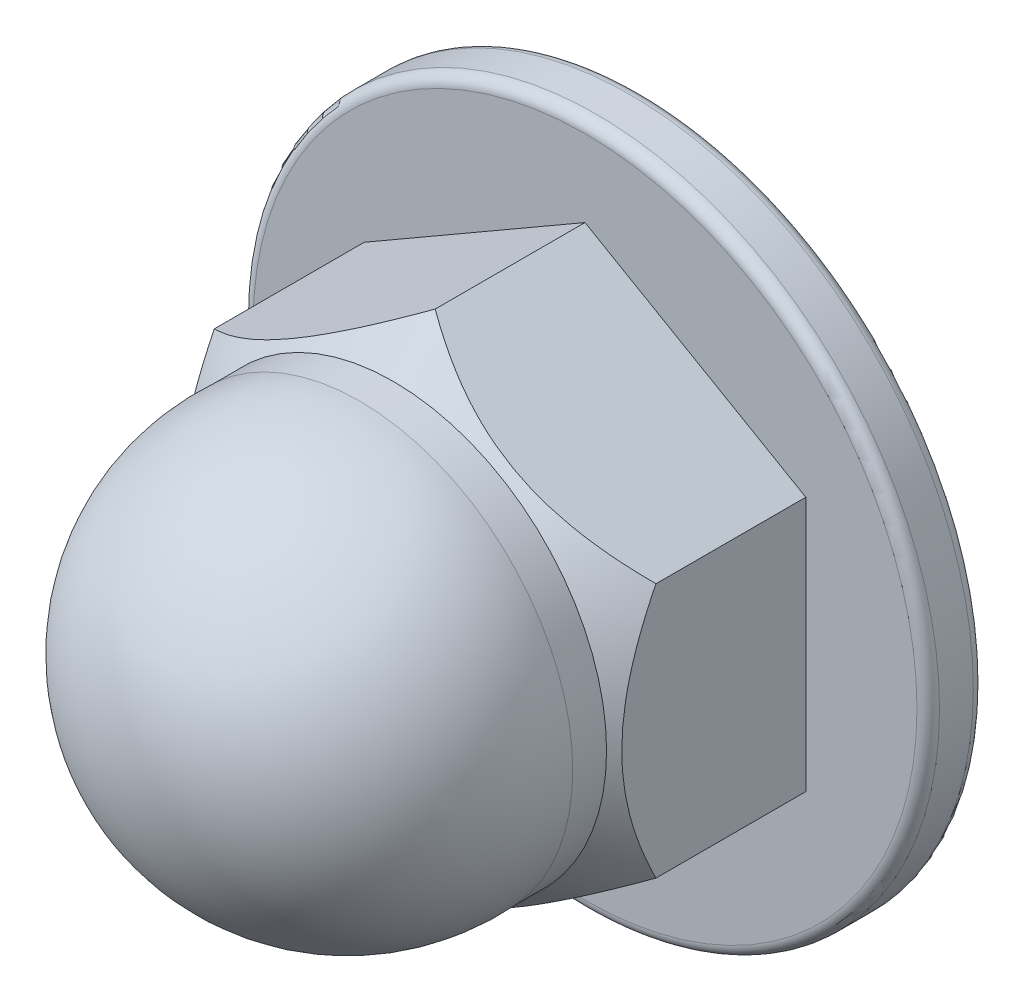
ISO-10303-21;
HEADER;
FILE_DESCRIPTION(('STEP AP214'),'2;1');
FILE_NAME('part.step','',(''),(''),'','','');
FILE_SCHEMA(('AUTOMOTIVE_DESIGN { 1 0 10303 214 1 1 1 1 }'));
ENDSEC;
DATA;
#1=APPLICATION_CONTEXT('core data for automotive mechanical design processes');
#2=APPLICATION_PROTOCOL_DEFINITION('international standard','automotive_design',2000,#1);
#3=PRODUCT_CONTEXT('',#1,'mechanical');
#4=PRODUCT('Part','Part','',(#3));
#5=PRODUCT_RELATED_PRODUCT_CATEGORY('part','',(#4));
#6=PRODUCT_DEFINITION_FORMATION('','',#4);
#7=PRODUCT_DEFINITION_CONTEXT('part definition',#1,'design');
#8=PRODUCT_DEFINITION('design','',#6,#7);
#9=PRODUCT_DEFINITION_SHAPE('','',#8);
#10=(LENGTH_UNIT() NAMED_UNIT(*) SI_UNIT(.MILLI.,.METRE.));
#11=(NAMED_UNIT(*) PLANE_ANGLE_UNIT() SI_UNIT($,.RADIAN.));
#12=(NAMED_UNIT(*) SI_UNIT($,.STERADIAN.) SOLID_ANGLE_UNIT());
#13=UNCERTAINTY_MEASURE_WITH_UNIT(LENGTH_MEASURE(1.E-05),#10,'distance_accuracy_value','');
#14=(GEOMETRIC_REPRESENTATION_CONTEXT(3) GLOBAL_UNCERTAINTY_ASSIGNED_CONTEXT((#13)) GLOBAL_UNIT_ASSIGNED_CONTEXT((#10,
#11,#12)) REPRESENTATION_CONTEXT('',''));
#15=CARTESIAN_POINT('',(0.,0.,0.));
#16=DIRECTION('',(0.,0.,1.));
#17=DIRECTION('',(1.,0.,0.));
#18=AXIS2_PLACEMENT_3D('',#15,#16,#17);
#19=CARTESIAN_POINT('',(19.588264162028,11.3092895869047,22.));
#20=DIRECTION('',(-0.499999999999995,-0.866025403784442,0.));
#21=DIRECTION('',(0.866025403784442,-0.499999999999995,0.));
#22=AXIS2_PLACEMENT_3D('',#19,#20,#21);
#23=PLANE('',#22);
#24=CARTESIAN_POINT('',(19.588464162028,11.3091741168509,18.2942357313316));
#25=CARTESIAN_POINT('',(19.2517027591216,11.5036034034715,18.4886344446605));
#26=CARTESIAN_POINT('',(18.9123039695039,11.69955538602,18.677101054873));
#27=CARTESIAN_POINT('',(18.2278211798347,12.0947417088911,19.0402857963339));
#28=CARTESIAN_POINT('',(17.88273419765,12.2939777709493,19.2149964193547));
#29=CARTESIAN_POINT('',(17.1848370294652,12.6969088888675,19.5495247710861));
#30=CARTESIAN_POINT('',(16.8319939369888,12.9006229432904,19.7092515046684));
#31=CARTESIAN_POINT('',(16.120512325639,13.3113970431267,20.0103429590666));
#32=CARTESIAN_POINT('',(15.761874702233,13.5184565715417,20.1517104871058));
#33=CARTESIAN_POINT('',(15.0445716120384,13.9325917037561,20.4116110053756));
#34=CARTESIAN_POINT('',(14.6859942783634,14.1396164238786,20.5304665011544));
#35=CARTESIAN_POINT('',(13.9638091157794,14.5565702219013,20.7456425560999));
#36=CARTESIAN_POINT('',(13.6002018227425,14.7664989904154,20.8419654965104));
#37=CARTESIAN_POINT('',(12.8695287009746,15.1883533139577,21.0096559314172));
#38=CARTESIAN_POINT('',(12.5024726051967,15.4002732496628,21.0810796189537));
#39=CARTESIAN_POINT('',(11.7652328262336,15.8259188345045,21.1973842663451));
#40=CARTESIAN_POINT('',(11.3950496187555,16.0396442089914,21.2422691921597));
#41=CARTESIAN_POINT('',(10.7585027769047,16.4071546994857,21.2954258112318));
#42=CARTESIAN_POINT('',(10.4925513883191,16.560701805277,21.3104795392384));
#43=CARTESIAN_POINT('',(9.96033441427492,16.8679774185087,21.3261335511371));
#44=CARTESIAN_POINT('',(9.69406884598619,17.0217059160361,21.3267345913236));
#45=CARTESIAN_POINT('',(9.16171479403473,17.3290606712345,21.313468812872));
#46=CARTESIAN_POINT('',(8.89562640926018,17.4826868718123,21.2995967610534));
#47=CARTESIAN_POINT('',(8.36429482631249,17.7894513042561,21.2575918392533));
#48=CARTESIAN_POINT('',(8.09905164270875,17.9425895277104,21.2294587247667));
#49=CARTESIAN_POINT('',(7.56967281896283,18.2482265341034,21.1593117011357));
#50=CARTESIAN_POINT('',(7.30553858770776,18.4007245036207,21.1172836357447));
#51=CARTESIAN_POINT('',(6.77910222400101,18.704662679918,21.019953244866));
#52=CARTESIAN_POINT('',(6.51680030500869,18.8561027634572,20.9646493984763));
#53=CARTESIAN_POINT('',(5.73335408668337,19.3084256485029,20.7799082272221));
#54=CARTESIAN_POINT('',(5.21547187103073,19.6074250851185,20.6316141813986));
#55=CARTESIAN_POINT('',(4.29626333923292,20.1381303783933,20.3265463022766));
#56=CARTESIAN_POINT('',(3.8928837307872,20.3710217039151,20.177798196704));
#57=CARTESIAN_POINT('',(3.09334950013998,20.8326330072055,19.8563335136281));
#58=CARTESIAN_POINT('',(2.6971950965767,21.0613528587435,19.6836162121625));
#59=CARTESIAN_POINT('',(1.91337860671201,21.5138895201621,19.3180848471989));
#60=CARTESIAN_POINT('',(1.52569421726947,21.7377192067674,19.1253339880035));
#61=CARTESIAN_POINT('',(0.757503482394074,22.1812343343367,18.7222654183388));
#62=CARTESIAN_POINT('',(0.376992909815275,22.4009222158445,18.5119584762474));
#63=CARTESIAN_POINT('',(-0.000199999999999147,22.6186946438628,18.2942357313316));
#64=B_SPLINE_CURVE_WITH_KNOTS('',3,(#24,#25,#26,#27,#28,#29,#30,#31,#32,#33,#34,#35,#36,#37,#38,
#39,#40,#41,#42,#43,#44,#45,#46,#47,#48,#49,#50,#51,#52,#53,#54,#55,#56,#57,#58,#59,#60,#61,#62,
#63),.UNSPECIFIED.,.F.,.F.,(4,2,2,2,2,2,2,2,2,2,2,2,2,2,2,2,2,2,2,4),(0.,1.30428556245881,
2.60927815867819,3.92174238277579,5.23400568702988,6.52574852634301,7.81735479234059,
9.10602697750421,10.3945065344435,11.3165802828963,12.2386057800634,13.1609647787806,
14.0833395918221,15.0066570358205,15.930080307578,17.7762402638776,19.24246594978,
20.708735931014,22.1705128218087,23.6313995990531),.UNSPECIFIED.);
#65=CARTESIAN_POINT('',(19.588264162028,11.3092895869047,18.2943512022696));
#66=VERTEX_POINT('',#65);
#67=CARTESIAN_POINT('',(0.,22.6185791738089,18.2943512022696));
#68=VERTEX_POINT('',#67);
#69=EDGE_CURVE('E89',#66,#68,#64,.T.);
#70=ORIENTED_EDGE('',*,*,#69,.F.);
#71=DIRECTION('',(0.,0.,-1.));
#72=VECTOR('',#71,1.);
#73=CARTESIAN_POINT('',(19.588264162028,11.3092895869047,22.));
#74=LINE('',#73,#72);
#75=CARTESIAN_POINT('',(19.588264162028,11.3092895869047,5.));
#76=VERTEX_POINT('',#75);
#77=EDGE_CURVE('E97',#66,#76,#74,.T.);
#78=ORIENTED_EDGE('',*,*,#77,.T.);
#79=DIRECTION('',(-0.866025403784442,0.499999999999995,0.));
#80=VECTOR('',#79,1.);
#81=CARTESIAN_POINT('',(19.588264162028,11.3092895869047,5.));
#82=LINE('',#81,#80);
#83=CARTESIAN_POINT('',(0.,22.6185791738089,5.));
#84=VERTEX_POINT('',#83);
#85=EDGE_CURVE('E99',#76,#84,#82,.T.);
#86=ORIENTED_EDGE('',*,*,#85,.T.);
#87=DIRECTION('',(0.,0.,-1.));
#88=VECTOR('',#87,1.);
#89=CARTESIAN_POINT('',(0.,22.6185791738089,22.));
#90=LINE('',#89,#88);
#91=EDGE_CURVE('E98',#68,#84,#90,.T.);
#92=ORIENTED_EDGE('',*,*,#91,.F.);
#93=EDGE_LOOP('',(#70,#78,#86,#92));
#94=FACE_BOUND('',#93,.T.);
#95=ADVANCED_FACE('F35',(#94),#23,.F.);
#96=CARTESIAN_POINT('',(0.,22.6185791738089,22.));
#97=DIRECTION('',(0.500000000000001,-0.866025403784438,0.));
#98=DIRECTION('',(0.866025403784438,0.500000000000001,0.));
#99=AXIS2_PLACEMENT_3D('',#96,#97,#98);
#100=PLANE('',#99);
#101=CARTESIAN_POINT('',(0.0002,22.6186946438628,18.2942357313316));
#102=CARTESIAN_POINT('',(-0.336561402906399,22.4242653572421,18.4886344446606));
#103=CARTESIAN_POINT('',(-0.675960192524193,22.2283133746936,18.677101054873));
#104=CARTESIAN_POINT('',(-1.36044298219333,21.8331270518225,19.0402857963339));
#105=CARTESIAN_POINT('',(-1.70552996437805,21.6338909897643,19.2149964193547));
#106=CARTESIAN_POINT('',(-2.40342713256286,21.2309598718461,19.5495247710861));
#107=CARTESIAN_POINT('',(-2.75627022503926,21.0272458174232,19.7092515046684));
#108=CARTESIAN_POINT('',(-3.46775183638908,20.6164717175869,20.0103429590667));
#109=CARTESIAN_POINT('',(-3.82638945979511,20.4094121891719,20.1517104871058));
#110=CARTESIAN_POINT('',(-4.54369254998969,19.9952770569575,20.4116110053756));
#111=CARTESIAN_POINT('',(-4.90226988366462,19.788252336835,20.5304665011545));
#112=CARTESIAN_POINT('',(-5.62445504624868,19.3712985388123,20.7456425560999));
#113=CARTESIAN_POINT('',(-5.98806233928555,19.1613697702982,20.8419654965104));
#114=CARTESIAN_POINT('',(-6.71873546105347,18.7395154467558,21.0096559314173));
#115=CARTESIAN_POINT('',(-7.08579155683142,18.5275955110507,21.0810796189538));
#116=CARTESIAN_POINT('',(-7.82303133579452,18.1019499262091,21.1973842663452));
#117=CARTESIAN_POINT('',(-8.19321454327257,17.8882245517221,21.2422691921598));
#118=CARTESIAN_POINT('',(-8.82976138512337,17.5207140612278,21.2954258112318));
#119=CARTESIAN_POINT('',(-9.09571277370896,17.3671669554365,21.3104795392385));
#120=CARTESIAN_POINT('',(-9.62792974775317,17.0598913422048,21.3261335511372));
#121=CARTESIAN_POINT('',(-9.8941953160419,16.9061628446774,21.3267345913237));
#122=CARTESIAN_POINT('',(-10.4265493679934,16.598808089479,21.3134688128721));
#123=CARTESIAN_POINT('',(-10.6926377527679,16.4451818889012,21.2995967610535));
#124=CARTESIAN_POINT('',(-11.2239693357156,16.1384174564574,21.2575918392534));
#125=CARTESIAN_POINT('',(-11.4892125193193,15.9852792330031,21.2294587247668));
#126=CARTESIAN_POINT('',(-12.0185913430652,15.6796422266101,21.1593117011358));
#127=CARTESIAN_POINT('',(-12.2827255743203,15.5271442570928,21.1172836357448));
#128=CARTESIAN_POINT('',(-12.8091619380271,15.2232060807955,21.0199532448661));
#129=CARTESIAN_POINT('',(-13.0714638570194,15.0717659972563,20.9646493984763));
#130=CARTESIAN_POINT('',(-13.8549100753447,14.6194431122106,20.7799082272222));
#131=CARTESIAN_POINT('',(-14.3727922909973,14.320443675595,20.6316141813987));
#132=CARTESIAN_POINT('',(-15.2920008227951,13.7897383823202,20.3265463022767));
#133=CARTESIAN_POINT('',(-15.6953804312409,13.5568470567984,20.177798196704));
#134=CARTESIAN_POINT('',(-16.4949146618881,13.0952357535079,19.8563335136282));
#135=CARTESIAN_POINT('',(-16.8910690654514,12.86651590197,19.6836162121625));
#136=CARTESIAN_POINT('',(-17.6748855553161,12.4139792405513,19.3180848471989));
#137=CARTESIAN_POINT('',(-18.0625699447587,12.190149553946,19.1253339880035));
#138=CARTESIAN_POINT('',(-18.8307606796341,11.7466344263767,18.7222654183388));
#139=CARTESIAN_POINT('',(-19.2112712522129,11.5269465448689,18.5119584762474));
#140=CARTESIAN_POINT('',(-19.5884641620282,11.3091741168506,18.2942357313316));
#141=B_SPLINE_CURVE_WITH_KNOTS('',3,(#101,#102,#103,#104,#105,#106,#107,#108,#109,#110,#111,
#112,#113,#114,#115,#116,#117,#118,#119,#120,#121,#122,#123,#124,#125,#126,#127,#128,#129,#130,
#131,#132,#133,#134,#135,#136,#137,#138,#139,#140),.UNSPECIFIED.,.F.,.F.,(4,2,2,2,2,2,2,2,2,2,2,
2,2,2,2,2,2,2,2,4),(0.,1.30428556245883,2.60927815867822,3.92174238277582,5.23400568702993,
6.52574852634309,7.81735479234068,9.10602697750431,10.3945065344436,11.3165802828965,
12.2386057800635,13.1609647787807,14.0833395918222,15.0066570358206,15.9300803075781,
17.7762402638777,19.2424659497802,20.7087359310142,22.170512821809,23.6313995990534),.UNSPECIFIED.);
#142=CARTESIAN_POINT('',(-19.5882641620282,11.3092895869044,18.2943512022696));
#143=VERTEX_POINT('',#142);
#144=EDGE_CURVE('E100',#68,#143,#141,.T.);
#145=ORIENTED_EDGE('',*,*,#144,.F.);
#146=ORIENTED_EDGE('',*,*,#91,.T.);
#147=DIRECTION('',(-0.866025403784438,-0.500000000000001,0.));
#148=VECTOR('',#147,1.);
#149=CARTESIAN_POINT('',(0.,22.6185791738089,5.));
#150=LINE('',#149,#148);
#151=CARTESIAN_POINT('',(-19.5882641620282,11.3092895869044,5.));
#152=VERTEX_POINT('',#151);
#153=EDGE_CURVE('E228',#84,#152,#150,.T.);
#154=ORIENTED_EDGE('',*,*,#153,.T.);
#155=DIRECTION('',(0.,0.,-1.));
#156=VECTOR('',#155,1.);
#157=CARTESIAN_POINT('',(-19.5882641620282,11.3092895869044,22.));
#158=LINE('',#157,#156);
#159=EDGE_CURVE('E116',#143,#152,#158,.T.);
#160=ORIENTED_EDGE('',*,*,#159,.F.);
#161=EDGE_LOOP('',(#145,#146,#154,#160));
#162=FACE_BOUND('',#161,.T.);
#163=ADVANCED_FACE('F143',(#162),#100,.F.);
#164=CARTESIAN_POINT('',(-19.5882641620282,11.3092895869044,22.));
#165=DIRECTION('',(1.,0.,0.));
#166=DIRECTION('',(0.,1.,0.));
#167=AXIS2_PLACEMENT_3D('',#164,#165,#166);
#168=PLANE('',#167);
#169=CARTESIAN_POINT('',(-19.5882641620281,-25.4087104781083,8.83018328294885));
#170=CARTESIAN_POINT('',(-19.5882641620281,-25.1049567184587,9.07074451308178));
#171=CARTESIAN_POINT('',(-19.5882641620281,-24.8004247467511,9.31032246897002));
#172=CARTESIAN_POINT('',(-19.5882641620281,-24.1896675243623,9.7873188579888));
#173=CARTESIAN_POINT('',(-19.5882641620281,-23.8834422494169,10.0247372600443));
#174=CARTESIAN_POINT('',(-19.5882641620281,-22.9619108308978,10.73354830707));
#175=CARTESIAN_POINT('',(-19.5882641620281,-22.3438711025044,11.2013999239994));
#176=CARTESIAN_POINT('',(-19.5882641620281,-21.0945529331648,12.1291871438591));
#177=CARTESIAN_POINT('',(-19.5882641620281,-20.4632095569793,12.5890354876408));
#178=CARTESIAN_POINT('',(-19.5882641620281,-19.1904123792575,13.4944705947041));
#179=CARTESIAN_POINT('',(-19.5882641620281,-18.5489592564878,13.9400583094053));
#180=CARTESIAN_POINT('',(-19.5882641620281,-17.2058587454264,14.8461373104484));
#181=CARTESIAN_POINT('',(-19.5882641620281,-16.5032873682199,15.3052654132651));
#182=CARTESIAN_POINT('',(-19.5882641620281,-15.081580300853,16.1975962517638));
#183=CARTESIAN_POINT('',(-19.5882641620281,-14.3624415894536,16.630794206128));
#184=CARTESIAN_POINT('',(-19.5882641620281,-12.9069962760576,17.4622412507637));
#185=CARTESIAN_POINT('',(-19.5882641620281,-12.1707481447819,17.8605920331365));
#186=CARTESIAN_POINT('',(-19.5882641620281,-10.6762562694742,18.6134663072793));
#187=CARTESIAN_POINT('',(-19.5882641620281,-9.91802378283902,18.9680117573831));
#188=CARTESIAN_POINT('',(-19.5882641620281,-8.81075928175542,19.4365093452468));
#189=CARTESIAN_POINT('',(-19.5882641620281,-8.47148276095477,19.5736072424749));
#190=CARTESIAN_POINT('',(-19.5882641620281,-7.7882505659787,19.8355197906072));
#191=CARTESIAN_POINT('',(-19.5882641620281,-7.44429500108185,19.96033472782));
#192=CARTESIAN_POINT('',(-19.5882641620281,-6.40522926559102,20.314301191213));
#193=CARTESIAN_POINT('',(-19.5882641620281,-5.70285787017731,20.5230011991894));
#194=CARTESIAN_POINT('',(-19.5882641620281,-4.64470020361749,20.7843543478706));
#195=CARTESIAN_POINT('',(-19.5882641620281,-4.29502244844346,20.8622808169963));
#196=CARTESIAN_POINT('',(-19.5882641620282,-3.5922982307445,21.0009699229918));
#197=CARTESIAN_POINT('',(-19.5882641620282,-3.23925236457696,21.0617355421211));
#198=CARTESIAN_POINT('',(-19.5882641620282,-2.5305368200367,21.1649984679363));
#199=CARTESIAN_POINT('',(-19.5882641620282,-2.17486747373792,21.2074980476612));
#200=CARTESIAN_POINT('',(-19.5882641620282,-1.46175744723511,21.2734086145493));
#201=CARTESIAN_POINT('',(-19.5882641620282,-1.10431680464449,21.2968200053168));
#202=CARTESIAN_POINT('',(-19.5882641620282,-0.409648245099098,21.3232755368374));
#203=CARTESIAN_POINT('',(-19.5882641620282,-0.0724624013135099,21.3274320741433));
#204=CARTESIAN_POINT('',(-19.5882641620282,0.601669387203539,21.3183261824958));
#205=CARTESIAN_POINT('',(-19.5882641620282,0.93861533567176,21.3050640310811));
#206=CARTESIAN_POINT('',(-19.5882641620282,1.61140372227381,21.2613651317967));
#207=CARTESIAN_POINT('',(-19.5882641620282,1.94724610046199,21.2309274659768));
#208=CARTESIAN_POINT('',(-19.5882641620282,2.61700043137454,21.1534231993652));
#209=CARTESIAN_POINT('',(-19.5882641620282,2.95091235490007,21.1063563477163));
#210=CARTESIAN_POINT('',(-19.5882641620282,3.62246686552148,20.9953348508706));
#211=CARTESIAN_POINT('',(-19.5882641620282,3.96005881699693,20.9310746907624));
#212=CARTESIAN_POINT('',(-19.5882641620282,4.63195845162271,20.7871417495073));
#213=CARTESIAN_POINT('',(-19.5882641620282,4.96626566421617,20.7074667929812));
#214=CARTESIAN_POINT('',(-19.5882641620282,5.9634358908415,20.4470753552176));
#215=CARTESIAN_POINT('',(-19.5882641620282,6.6207785769318,20.244952693287));
#216=CARTESIAN_POINT('',(-19.5882641620282,7.92488600366805,19.7912360920596));
#217=CARTESIAN_POINT('',(-19.5882641620282,8.57148884978252,19.5391863170119));
#218=CARTESIAN_POINT('',(-19.5882641620282,9.84822286663817,18.9959577494807));
#219=CARTESIAN_POINT('',(-19.5882641620282,10.4783467636644,18.7047620151314));
#220=CARTESIAN_POINT('',(-19.5882641620282,11.7249547832444,18.090143073872));
#221=CARTESIAN_POINT('',(-19.5882641620282,12.3413908307763,17.7666232178223));
#222=CARTESIAN_POINT('',(-19.5882641620282,13.5601910325811,17.0944388600118));
#223=CARTESIAN_POINT('',(-19.5882641620282,14.1625572573449,16.7457780892036));
#224=CARTESIAN_POINT('',(-19.5882641620282,15.325620606128,16.04588599422));
#225=CARTESIAN_POINT('',(-19.5882641620282,15.8869075671627,15.695629657742));
#226=CARTESIAN_POINT('',(-19.5882641620282,16.9998368546081,14.980076352243));
#227=CARTESIAN_POINT('',(-19.5882641620282,17.5514784653685,14.6147782738686));
#228=CARTESIAN_POINT('',(-19.5882641620282,18.6419893766763,13.8747208155346));
#229=CARTESIAN_POINT('',(-19.5882641620282,19.1809252282748,13.5000592710003));
#230=CARTESIAN_POINT('',(-19.5882641620282,19.983818601689,12.9304787015224));
#231=CARTESIAN_POINT('',(-19.5882641620282,20.2504976116987,12.7393786984388));
#232=CARTESIAN_POINT('',(-19.5882641620282,20.782156854043,12.3548409349523));
#233=CARTESIAN_POINT('',(-19.5882641620282,21.0471371213068,12.1614032228545));
#234=CARTESIAN_POINT('',(-19.5882641620282,21.3113306708894,11.9668959698704));
#235=B_SPLINE_CURVE_WITH_KNOTS('',3,(#169,#170,#171,#172,#173,#174,#175,#176,#177,#178,#179,
#180,#181,#182,#183,#184,#185,#186,#187,#188,#189,#190,#191,#192,#193,#194,#195,#196,#197,#198,
#199,#200,#201,#202,#203,#204,#205,#206,#207,#208,#209,#210,#211,#212,#213,#214,#215,#216,#217,
#218,#219,#220,#221,#222,#223,#224,#225,#226,#227,#228,#229,#230,#231,#232,#233,#234),
.UNSPECIFIED.,.F.,.F.,(4,2,2,2,2,2,2,2,2,2,2,2,2,2,2,2,2,2,2,2,2,2,2,2,2,2,2,2,2,2,2,2,4),(0.,
1.16241805933151,2.32485281896615,4.65018965524851,6.99321055197055,9.33607480324282,
11.8534995671424,14.371387103641,16.8816630289392,19.3906754765741,20.4882482337193,
21.5857954010332,23.7806870290568,24.8551158805779,25.9293578998467,27.0034662009345,
28.0775517902842,29.0887404841512,30.0999130665459,31.1111396964617,32.1223815817403,
33.1529467995053,34.1836575597475,36.2443782031886,38.3248609333398,40.4062469858546,
42.4940540296582,44.5815518746346,46.5660884643886,48.5507716800727,50.5197377558302,
51.5039693743835,52.4881806899812),.UNSPECIFIED.);
#236=CARTESIAN_POINT('',(-19.5882641620281,-11.3092895869046,18.2943512022696));
#237=VERTEX_POINT('',#236);
#238=EDGE_CURVE('E196',#143,#237,#235,.F.);
#239=ORIENTED_EDGE('',*,*,#238,.F.);
#240=ORIENTED_EDGE('',*,*,#159,.T.);
#241=DIRECTION('',(0.,-1.,0.));
#242=VECTOR('',#241,1.);
#243=CARTESIAN_POINT('',(-19.5882641620282,11.3092895869044,5.));
#244=LINE('',#243,#242);
#245=CARTESIAN_POINT('',(-19.5882641620281,-11.3092895869046,5.));
#246=VERTEX_POINT('',#245);
#247=EDGE_CURVE('E224',#152,#246,#244,.T.);
#248=ORIENTED_EDGE('',*,*,#247,.T.);
#249=DIRECTION('',(0.,0.,-1.));
#250=VECTOR('',#249,1.);
#251=CARTESIAN_POINT('',(-19.5882641620281,-11.3092895869046,22.));
#252=LINE('',#251,#250);
#253=EDGE_CURVE('E114',#237,#246,#252,.T.);
#254=ORIENTED_EDGE('',*,*,#253,.F.);
#255=EDGE_LOOP('',(#239,#240,#248,#254));
#256=FACE_BOUND('',#255,.T.);
#257=ADVANCED_FACE('F148',(#256),#168,.F.);
#258=CARTESIAN_POINT('',(-19.5882641620281,-11.3092895869046,22.));
#259=DIRECTION('',(0.499999999999995,0.866025403784442,0.));
#260=DIRECTION('',(-0.866025403784442,0.499999999999995,0.));
#261=AXIS2_PLACEMENT_3D('',#258,#259,#260);
#262=PLANE('',#261);
#263=CARTESIAN_POINT('',(-19.5884641620281,-11.3091741168507,18.2942357313316));
#264=CARTESIAN_POINT('',(-19.2517027591217,-11.5036034034714,18.4886344446606));
#265=CARTESIAN_POINT('',(-18.9123039695039,-11.6995553860199,18.677101054873));
#266=CARTESIAN_POINT('',(-18.2278211798348,-12.094741708891,19.0402857963339));
#267=CARTESIAN_POINT('',(-17.8827341976501,-12.2939777709492,19.2149964193547));
#268=CARTESIAN_POINT('',(-17.1848370294653,-12.6969088888674,19.5495247710861));
#269=CARTESIAN_POINT('',(-16.8319939369889,-12.9006229432903,19.7092515046684));
#270=CARTESIAN_POINT('',(-16.120512325639,-13.3113970431266,20.0103429590667));
#271=CARTESIAN_POINT('',(-15.761874702233,-13.5184565715416,20.1517104871058));
#272=CARTESIAN_POINT('',(-15.0445716120384,-13.932591703756,20.4116110053756));
#273=CARTESIAN_POINT('',(-14.6859942783635,-14.1396164238785,20.5304665011545));
#274=CARTESIAN_POINT('',(-13.9638091157794,-14.5565702219012,20.7456425560999));
#275=CARTESIAN_POINT('',(-13.6002018227425,-14.7664989904153,20.8419654965104));
#276=CARTESIAN_POINT('',(-12.8695287009746,-15.1883533139576,21.0096559314173));
#277=CARTESIAN_POINT('',(-12.5024726051967,-15.4002732496627,21.0810796189538));
#278=CARTESIAN_POINT('',(-11.7652328262336,-15.8259188345044,21.1973842663452));
#279=CARTESIAN_POINT('',(-11.3950496187555,-16.0396442089913,21.2422691921598));
#280=CARTESIAN_POINT('',(-10.7585027769047,-16.4071546994857,21.2954258112318));
#281=CARTESIAN_POINT('',(-10.4925513883191,-16.5607018052769,21.3104795392385));
#282=CARTESIAN_POINT('',(-9.96033441427491,-16.8679774185086,21.3261335511372));
#283=CARTESIAN_POINT('',(-9.69406884598619,-17.021705916036,21.3267345913237));
#284=CARTESIAN_POINT('',(-9.16171479403473,-17.3290606712344,21.3134688128721));
#285=CARTESIAN_POINT('',(-8.89562640926018,-17.4826868718122,21.2995967610535));
#286=CARTESIAN_POINT('',(-8.3642948263125,-17.789451304256,21.2575918392534));
#287=CARTESIAN_POINT('',(-8.09905164270875,-17.9425895277103,21.2294587247668));
#288=CARTESIAN_POINT('',(-7.56967281896283,-18.2482265341033,21.1593117011358));
#289=CARTESIAN_POINT('',(-7.30553858770777,-18.4007245036206,21.1172836357448));
#290=CARTESIAN_POINT('',(-6.77910222400101,-18.7046626799179,21.0199532448661));
#291=CARTESIAN_POINT('',(-6.5168003050087,-18.8561027634571,20.9646493984763));
#292=CARTESIAN_POINT('',(-5.73335408668338,-19.3084256485028,20.7799082272222));
#293=CARTESIAN_POINT('',(-5.21547187103074,-19.6074250851184,20.6316141813987));
#294=CARTESIAN_POINT('',(-4.29626333923292,-20.1381303783932,20.3265463022767));
#295=CARTESIAN_POINT('',(-3.89288373078718,-20.371021703915,20.177798196704));
#296=CARTESIAN_POINT('',(-3.09334950013994,-20.8326330072055,19.8563335136282));
#297=CARTESIAN_POINT('',(-2.69719509657664,-21.0613528587434,19.6836162121625));
#298=CARTESIAN_POINT('',(-1.91337860671192,-21.5138895201621,19.3180848471989));
#299=CARTESIAN_POINT('',(-1.52569421726937,-21.7377192067673,19.1253339880035));
#300=CARTESIAN_POINT('',(-0.757503482393938,-22.1812343343366,18.7222654183388));
#301=CARTESIAN_POINT('',(-0.376992909815126,-22.4009222158445,18.5119584762474));
#302=CARTESIAN_POINT('',(0.000200000000157354,-22.6186946438628,18.2942357313316));
#303=B_SPLINE_CURVE_WITH_KNOTS('',3,(#263,#264,#265,#266,#267,#268,#269,#270,#271,#272,#273,
#274,#275,#276,#277,#278,#279,#280,#281,#282,#283,#284,#285,#286,#287,#288,#289,#290,#291,#292,
#293,#294,#295,#296,#297,#298,#299,#300,#301,#302),.UNSPECIFIED.,.F.,.F.,(4,2,2,2,2,2,2,2,2,2,2,
2,2,2,2,2,2,2,2,4),(0.,1.30428556245883,2.60927815867822,3.92174238277582,5.23400568702993,
6.52574852634309,7.81735479234069,9.10602697750432,10.3945065344436,11.3165802828965,
12.2386057800635,13.1609647787807,14.0833395918222,15.0066570358206,15.9300803075781,
17.7762402638777,19.2424659497802,20.7087359310142,22.170512821809,23.6313995990534),.UNSPECIFIED.);
#304=CARTESIAN_POINT('',(1.58463031985118E-13,-22.6185791738089,18.2943512022696));
#305=VERTEX_POINT('',#304);
#306=EDGE_CURVE('E191',#237,#305,#303,.T.);
#307=ORIENTED_EDGE('',*,*,#306,.F.);
#308=ORIENTED_EDGE('',*,*,#253,.T.);
#309=DIRECTION('',(0.866025403784441,-0.499999999999995,0.));
#310=VECTOR('',#309,1.);
#311=CARTESIAN_POINT('',(-19.5882641620281,-11.3092895869046,5.));
#312=LINE('',#311,#310);
#313=CARTESIAN_POINT('',(1.57944694193E-13,-22.6185791738089,5.));
#314=VERTEX_POINT('',#313);
#315=EDGE_CURVE('E219',#246,#314,#312,.T.);
#316=ORIENTED_EDGE('',*,*,#315,.T.);
#317=DIRECTION('',(0.,0.,-1.));
#318=VECTOR('',#317,1.);
#319=CARTESIAN_POINT('',(1.57944694193E-13,-22.6185791738089,22.));
#320=LINE('',#319,#318);
#321=EDGE_CURVE('E107',#305,#314,#320,.T.);
#322=ORIENTED_EDGE('',*,*,#321,.F.);
#323=EDGE_LOOP('',(#307,#308,#316,#322));
#324=FACE_BOUND('',#323,.T.);
#325=ADVANCED_FACE('F202',(#324),#262,.F.);
#326=CARTESIAN_POINT('',(1.57944694193E-13,-22.6185791738089,22.));
#327=DIRECTION('',(-0.500000000000007,0.866025403784435,0.));
#328=DIRECTION('',(-0.866025403784435,-0.500000000000007,0.));
#329=AXIS2_PLACEMENT_3D('',#326,#327,#328);
#330=PLANE('',#329);
#331=CARTESIAN_POINT('',(-0.000199999999842055,-22.6186946438628,18.2942357313316));
#332=CARTESIAN_POINT('',(0.336561402906554,-22.4242653572421,18.4886344446606));
#333=CARTESIAN_POINT('',(0.675960192524347,-22.2283133746936,18.677101054873));
#334=CARTESIAN_POINT('',(1.36044298219349,-21.8331270518225,19.0402857963339));
#335=CARTESIAN_POINT('',(1.7055299643782,-21.6338909897643,19.2149964193547));
#336=CARTESIAN_POINT('',(2.40342713256301,-21.2309598718461,19.5495247710861));
#337=CARTESIAN_POINT('',(2.7562702250394,-21.0272458174232,19.7092515046684));
#338=CARTESIAN_POINT('',(3.46775183638922,-20.6164717175869,20.0103429590667));
#339=CARTESIAN_POINT('',(3.82638945979526,-20.4094121891718,20.1517104871058));
#340=CARTESIAN_POINT('',(4.54369254998983,-19.9952770569575,20.4116110053756));
#341=CARTESIAN_POINT('',(4.90226988366476,-19.7882523368349,20.5304665011545));
#342=CARTESIAN_POINT('',(5.62445504624881,-19.3712985388123,20.7456425560999));
#343=CARTESIAN_POINT('',(5.98806233928569,-19.1613697702981,20.8419654965104));
#344=CARTESIAN_POINT('',(6.7187354610536,-18.7395154467558,21.0096559314173));
#345=CARTESIAN_POINT('',(7.08579155683155,-18.5275955110507,21.0810796189538));
#346=CARTESIAN_POINT('',(7.82303133579465,-18.101949926209,21.1973842663452));
#347=CARTESIAN_POINT('',(8.1932145432727,-17.8882245517221,21.2422691921598));
#348=CARTESIAN_POINT('',(8.8297613851235,-17.5207140612277,21.2954258112319));
#349=CARTESIAN_POINT('',(9.09571277370909,-17.3671669554365,21.3104795392385));
#350=CARTESIAN_POINT('',(9.6279297477533,-17.0598913422048,21.3261335511372));
#351=CARTESIAN_POINT('',(9.89419531604202,-16.9061628446773,21.3267345913237));
#352=CARTESIAN_POINT('',(10.4265493679935,-16.598808089479,21.3134688128721));
#353=CARTESIAN_POINT('',(10.692637752768,-16.4451818889011,21.2995967610535));
#354=CARTESIAN_POINT('',(11.2239693357157,-16.1384174564573,21.2575918392534));
#355=CARTESIAN_POINT('',(11.4892125193194,-15.985279233003,21.2294587247668));
#356=CARTESIAN_POINT('',(12.0185913430654,-15.67964222661,21.1593117011358));
#357=CARTESIAN_POINT('',(12.2827255743204,-15.5271442570927,21.1172836357448));
#358=CARTESIAN_POINT('',(12.8091619380272,-15.2232060807954,21.0199532448661));
#359=CARTESIAN_POINT('',(13.0714638570195,-15.0717659972562,20.9646493984763));
#360=CARTESIAN_POINT('',(13.8549100753448,-14.6194431122105,20.7799082272222));
#361=CARTESIAN_POINT('',(14.3727922909974,-14.3204436755949,20.6316141813987));
#362=CARTESIAN_POINT('',(15.2920008227952,-13.78973838232,20.3265463022767));
#363=CARTESIAN_POINT('',(15.695380431241,-13.5568470567983,20.177798196704));
#364=CARTESIAN_POINT('',(16.4949146618882,-13.0952357535078,19.8563335136282));
#365=CARTESIAN_POINT('',(16.8910690654515,-12.8665159019699,19.6836162121625));
#366=CARTESIAN_POINT('',(17.6748855553162,-12.4139792405512,19.3180848471989));
#367=CARTESIAN_POINT('',(18.0625699447588,-12.1901495539459,19.1253339880035));
#368=CARTESIAN_POINT('',(18.8307606796342,-11.7466344263766,18.7222654183388));
#369=CARTESIAN_POINT('',(19.211271252213,-11.5269465448687,18.5119584762474));
#370=CARTESIAN_POINT('',(19.5884641620283,-11.3091741168505,18.2942357313316));
#371=B_SPLINE_CURVE_WITH_KNOTS('',3,(#331,#332,#333,#334,#335,#336,#337,#338,#339,#340,#341,
#342,#343,#344,#345,#346,#347,#348,#349,#350,#351,#352,#353,#354,#355,#356,#357,#358,#359,#360,
#361,#362,#363,#364,#365,#366,#367,#368,#369,#370),.UNSPECIFIED.,.F.,.F.,(4,2,2,2,2,2,2,2,2,2,2,
2,2,2,2,2,2,2,2,4),(0.,1.30428556245883,2.60927815867822,3.92174238277582,5.23400568702993,
6.52574852634309,7.81735479234069,9.10602697750431,10.3945065344436,11.3165802828965,
12.2386057800635,13.1609647787807,14.0833395918222,15.0066570358206,15.9300803075781,
17.7762402638777,19.2424659497802,20.7087359310142,22.170512821809,23.6313995990534),.UNSPECIFIED.);
#372=CARTESIAN_POINT('',(19.5882641620283,-11.3092895869043,18.2943512022696));
#373=VERTEX_POINT('',#372);
#374=EDGE_CURVE('E50',#305,#373,#371,.T.);
#375=ORIENTED_EDGE('',*,*,#374,.F.);
#376=ORIENTED_EDGE('',*,*,#321,.T.);
#377=DIRECTION('',(0.866025403784434,0.500000000000007,0.));
#378=VECTOR('',#377,1.);
#379=CARTESIAN_POINT('',(1.57944694193E-13,-22.6185791738089,5.));
#380=LINE('',#379,#378);
#381=CARTESIAN_POINT('',(19.5882641620283,-11.3092895869043,5.));
#382=VERTEX_POINT('',#381);
#383=EDGE_CURVE('E109',#314,#382,#380,.T.);
#384=ORIENTED_EDGE('',*,*,#383,.T.);
#385=DIRECTION('',(0.,0.,-1.));
#386=VECTOR('',#385,1.);
#387=CARTESIAN_POINT('',(19.5882641620283,-11.3092895869043,22.));
#388=LINE('',#387,#386);
#389=EDGE_CURVE('E57',#373,#382,#388,.T.);
#390=ORIENTED_EDGE('',*,*,#389,.F.);
#391=EDGE_LOOP('',(#375,#376,#384,#390));
#392=FACE_BOUND('',#391,.T.);
#393=ADVANCED_FACE('F206',(#392),#330,.F.);
#394=CARTESIAN_POINT('',(19.5882641620283,-11.3092895869043,22.));
#395=DIRECTION('',(-1.,0.,0.));
#396=DIRECTION('',(0.,-1.,0.));
#397=AXIS2_PLACEMENT_3D('',#394,#395,#396);
#398=PLANE('',#397);
#399=CARTESIAN_POINT('',(19.5882641620284,-25.4087104905612,8.83018327308631));
#400=CARTESIAN_POINT('',(19.5882641620284,-25.1049567307247,9.0707445034111));
#401=CARTESIAN_POINT('',(19.5882641620284,-24.8004247588301,9.31032245949105));
#402=CARTESIAN_POINT('',(19.5882641620284,-24.1896675360666,9.78731884889281));
#403=CARTESIAN_POINT('',(19.5882641620284,-23.8834422609335,10.0247372511396));
#404=CARTESIAN_POINT('',(19.5882641620284,-22.9619108418501,10.7335482987384));
#405=CARTESIAN_POINT('',(19.5882641620284,-22.3438711130789,11.201399916049));
#406=CARTESIAN_POINT('',(19.5882641620284,-21.0945529429718,12.1291871366739));
#407=CARTESIAN_POINT('',(19.5882641620284,-20.4632095663965,12.5890354808396));
#408=CARTESIAN_POINT('',(19.5882641620284,-19.190412387889,13.4944705886655));
#409=CARTESIAN_POINT('',(19.5882641620284,-18.5489592647234,13.9400583037452));
#410=CARTESIAN_POINT('',(19.5882641620283,-17.205858752805,14.8461373055825));
#411=CARTESIAN_POINT('',(19.5882641620283,-16.5032873751363,15.3052654088135));
#412=CARTESIAN_POINT('',(19.5882641620283,-15.0815803068292,16.1975962481231));
#413=CARTESIAN_POINT('',(19.5882641620283,-14.3624415949518,16.6307942028839));
#414=CARTESIAN_POINT('',(19.5882641620283,-12.9069962805829,17.4622412482812));
#415=CARTESIAN_POINT('',(19.5882641620283,-12.1707481488125,17.8605920310193));
#416=CARTESIAN_POINT('',(19.5882641620283,-10.6762562724878,18.6134663058476));
#417=CARTESIAN_POINT('',(19.5882641620283,-9.91802378533043,18.9680117562717));
#418=CARTESIAN_POINT('',(19.5882641620283,-8.81075928387148,19.4365093443763));
#419=CARTESIAN_POINT('',(19.5882641620283,-8.4714827632367,19.5736072415664));
#420=CARTESIAN_POINT('',(19.5882641620282,-7.78825056859667,19.8355197896372));
#421=CARTESIAN_POINT('',(19.5882641620282,-7.44429500386998,19.9603347268265));
#422=CARTESIAN_POINT('',(19.5882641620282,-6.40522926889539,20.3143011901743));
#423=CARTESIAN_POINT('',(19.5882641620282,-5.70285787383425,20.5230011981537));
#424=CARTESIAN_POINT('',(19.5882641620282,-4.64470020779995,20.7843543469024));
#425=CARTESIAN_POINT('',(19.5882641620282,-4.29502245279603,20.8622808160607));
#426=CARTESIAN_POINT('',(19.5882641620282,-3.59229823543754,21.0009699221419));
#427=CARTESIAN_POINT('',(19.5882641620282,-3.23925236944036,21.0617355413243));
#428=CARTESIAN_POINT('',(19.5882641620282,-2.53053682523921,21.1649984672664));
#429=CARTESIAN_POINT('',(19.5882641620282,-2.17486747910917,21.2074980470652));
#430=CARTESIAN_POINT('',(19.5882641620282,-1.46175745294037,21.2734086141215));
#431=CARTESIAN_POINT('',(19.5882641620282,-1.10431681051503,21.2968200049833));
#432=CARTESIAN_POINT('',(19.5882641620282,-0.409648251225395,21.3232755367076));
#433=CARTESIAN_POINT('',(19.5882641620282,-0.0724624075304782,21.3274320741188));
#434=CARTESIAN_POINT('',(19.5882641620282,0.601669380810987,21.3183261826906));
#435=CARTESIAN_POINT('',(19.5882641620282,0.938615329194295,21.3050640313899));
#436=CARTESIAN_POINT('',(19.5882641620281,1.61140371563257,21.26136513234));
#437=CARTESIAN_POINT('',(19.5882641620281,1.94724609374191,21.2309274666406));
#438=CARTESIAN_POINT('',(19.5882641620281,2.6170004245029,21.1534232002743));
#439=CARTESIAN_POINT('',(19.5882641620281,2.95091234795574,21.1063563487501));
#440=CARTESIAN_POINT('',(19.5882641620281,3.62246685842796,20.9953348521598));
#441=CARTESIAN_POINT('',(19.5882641620281,3.9600588098271,20.9310746921827));
#442=CARTESIAN_POINT('',(19.5882641620281,4.63195844430577,20.7871417511907));
#443=CARTESIAN_POINT('',(19.5882641620281,4.96626565682843,20.7074667947965));
#444=CARTESIAN_POINT('',(19.5882641620281,5.96343588324864,20.4470753574279));
#445=CARTESIAN_POINT('',(19.5882641620281,6.6207785692118,20.2449526957591));
#446=CARTESIAN_POINT('',(19.5882641620281,7.92488599509194,19.7912360952598));
#447=CARTESIAN_POINT('',(19.5882641620281,8.57148884049355,19.5391863207232));
#448=CARTESIAN_POINT('',(19.5882641620281,9.84822285595964,18.9959577542656));
#449=CARTESIAN_POINT('',(19.5882641620281,10.4783467523092,18.7047620204787));
#450=CARTESIAN_POINT('',(19.588264162028,11.7249547705603,18.0901430803781));
#451=CARTESIAN_POINT('',(19.588264162028,12.34139081744,17.7666232249252));
#452=CARTESIAN_POINT('',(19.588264162028,13.5601910179621,17.0944388683269));
#453=CARTESIAN_POINT('',(19.588264162028,14.1625572420952,16.7457780981343));
#454=CARTESIAN_POINT('',(19.588264162028,15.3256205897369,16.0458860043177));
#455=CARTESIAN_POINT('',(19.588264162028,15.8869075502587,15.6956296683883));
#456=CARTESIAN_POINT('',(19.588264162028,16.9998368366857,14.9800763639885));
#457=CARTESIAN_POINT('',(19.588264162028,17.5514784469407,14.6147782861649));
#458=CARTESIAN_POINT('',(19.588264162028,18.6419893572499,13.8747208289262));
#459=CARTESIAN_POINT('',(19.588264162028,19.1809252083552,13.5000592849363));
#460=CARTESIAN_POINT('',(19.588264162028,19.983818581032,12.9304787162744));
#461=CARTESIAN_POINT('',(19.588264162028,20.2504975907963,12.7393787134627));
#462=CARTESIAN_POINT('',(19.5882641620279,20.7821568326504,12.3548409505197));
#463=CARTESIAN_POINT('',(19.5882641620279,21.0471370996695,12.1614032386936));
#464=CARTESIAN_POINT('',(19.5882641620279,21.3113306490076,11.9668959859809));
#465=B_SPLINE_CURVE_WITH_KNOTS('',3,(#399,#400,#401,#402,#403,#404,#405,#406,#407,#408,#409,
#410,#411,#412,#413,#414,#415,#416,#417,#418,#419,#420,#421,#422,#423,#424,#425,#426,#427,#428,
#429,#430,#431,#432,#433,#434,#435,#436,#437,#438,#439,#440,#441,#442,#443,#444,#445,#446,#447,
#448,#449,#450,#451,#452,#453,#454,#455,#456,#457,#458,#459,#460,#461,#462,#463,#464),
.UNSPECIFIED.,.F.,.F.,(4,2,2,2,2,2,2,2,2,2,2,2,2,2,2,2,2,2,2,2,2,2,2,2,2,2,2,2,2,2,2,2,4),(0.,
1.16241806012812,2.32485282055936,4.6501896584354,6.99321055678096,9.33607480967646,
11.8534995754165,14.3713871137567,16.8816630408805,19.3906754903379,20.4882482469795,
21.5857954137897,23.7806870408084,24.8551158918534,25.9293579106464,27.0034662112587,
28.0775518001329,29.0887404937321,30.0999130758591,31.1111397055069,32.1223815905174,
33.152946807984,34.1836575679278,36.2443782107723,38.3248609383774,40.406246988343,
42.4940540295831,44.581551871997,46.5660884595744,48.5507716730818,50.519737746692,
51.5039693641718,52.4881806786959),.UNSPECIFIED.);
#466=EDGE_CURVE('E86',#373,#66,#465,.T.);
#467=ORIENTED_EDGE('',*,*,#466,.F.);
#468=ORIENTED_EDGE('',*,*,#389,.T.);
#469=DIRECTION('',(0.,1.,0.));
#470=VECTOR('',#469,1.);
#471=CARTESIAN_POINT('',(19.5882641620283,-11.3092895869043,5.));
#472=LINE('',#471,#470);
#473=EDGE_CURVE('E104',#382,#76,#472,.T.);
#474=ORIENTED_EDGE('',*,*,#473,.T.);
#475=ORIENTED_EDGE('',*,*,#77,.F.);
#476=EDGE_LOOP('',(#467,#468,#474,#475));
#477=FACE_BOUND('',#476,.T.);
#478=ADVANCED_FACE('F102',(#477),#398,.F.);
#479=CARTESIAN_POINT('',(0.,0.,5.));
#480=DIRECTION('',(0.,0.,1.));
#481=DIRECTION('',(1.,0.,0.));
#482=AXIS2_PLACEMENT_3D('',#479,#480,#481);
#483=PLANE('',#482);
#484=CARTESIAN_POINT('',(0.,0.,5.));
#485=DIRECTION('',(0.,0.,1.));
#486=DIRECTION('',(1.,0.,0.));
#487=AXIS2_PLACEMENT_3D('',#484,#485,#486);
#488=CIRCLE('',#487,29.4530130835349);
#489=CARTESIAN_POINT('',(29.4530130835349,0.,5.));
#490=VERTEX_POINT('',#489);
#491=EDGE_CURVE('E119',#490,#490,#488,.T.);
#492=ORIENTED_EDGE('',*,*,#491,.T.);
#493=EDGE_LOOP('',(#492));
#494=FACE_BOUND('',#493,.T.);
#495=ORIENTED_EDGE('',*,*,#153,.F.);
#496=ORIENTED_EDGE('',*,*,#85,.F.);
#497=ORIENTED_EDGE('',*,*,#473,.F.);
#498=ORIENTED_EDGE('',*,*,#383,.F.);
#499=ORIENTED_EDGE('',*,*,#315,.F.);
#500=ORIENTED_EDGE('',*,*,#247,.F.);
#501=EDGE_LOOP('',(#495,#496,#497,#498,#499,#500));
#502=FACE_BOUND('',#501,.T.);
#503=ADVANCED_FACE('F155',(#494,#502),#483,.T.);
#504=CARTESIAN_POINT('',(0.,0.,5.));
#505=DIRECTION('',(0.,0.,-1.));
#506=DIRECTION('',(-1.,0.,0.));
#507=AXIS2_PLACEMENT_3D('',#504,#505,#506);
#508=CYLINDRICAL_SURFACE('',#507,30.4530130835349);
#509=CARTESIAN_POINT('',(0.,0.,1.));
#510=DIRECTION('',(0.,0.,1.));
#511=DIRECTION('',(1.,0.,0.));
#512=AXIS2_PLACEMENT_3D('',#509,#510,#511);
#513=CIRCLE('',#512,30.4530130835349);
#514=CARTESIAN_POINT('',(30.4530130835349,0.,1.));
#515=VERTEX_POINT('',#514);
#516=EDGE_CURVE('E43',#515,#515,#513,.T.);
#517=ORIENTED_EDGE('',*,*,#516,.T.);
#518=EDGE_LOOP('',(#517));
#519=FACE_BOUND('',#518,.T.);
#520=CARTESIAN_POINT('',(0.,0.,4.));
#521=DIRECTION('',(0.,0.,1.));
#522=DIRECTION('',(1.,0.,0.));
#523=AXIS2_PLACEMENT_3D('',#520,#521,#522);
#524=CIRCLE('',#523,30.4530130835349);
#525=CARTESIAN_POINT('',(30.4530130835349,0.,4.));
#526=VERTEX_POINT('',#525);
#527=EDGE_CURVE('E125',#526,#526,#524,.F.);
#528=ORIENTED_EDGE('',*,*,#527,.T.);
#529=EDGE_LOOP('',(#528));
#530=FACE_BOUND('',#529,.T.);
#531=ADVANCED_FACE('F130',(#519,#530),#508,.T.);
#532=CARTESIAN_POINT('',(0.,0.,0.));
#533=DIRECTION('',(0.,0.,1.));
#534=DIRECTION('',(1.,0.,0.));
#535=AXIS2_PLACEMENT_3D('',#532,#533,#534);
#536=PLANE('',#535);
#537=CARTESIAN_POINT('',(0.,0.,0.));
#538=DIRECTION('',(0.,0.,1.));
#539=DIRECTION('',(1.,0.,0.));
#540=AXIS2_PLACEMENT_3D('',#537,#538,#539);
#541=CIRCLE('',#540,29.4530130835349);
#542=CARTESIAN_POINT('',(29.4530130835349,0.,0.));
#543=VERTEX_POINT('',#542);
#544=EDGE_CURVE('E11',#543,#543,#541,.F.);
#545=ORIENTED_EDGE('',*,*,#544,.T.);
#546=EDGE_LOOP('',(#545));
#547=FACE_BOUND('',#546,.T.);
#548=ADVANCED_FACE('F173',(#547),#536,.F.);
#549=CARTESIAN_POINT('',(0.,0.,22.));
#550=DIRECTION('',(0.,0.,-1.));
#551=DIRECTION('',(1.,0.,0.));
#552=AXIS2_PLACEMENT_3D('',#549,#550,#551);
#553=CONICAL_SURFACE('',#552,18.9129303760786,0.78539816339745);
#554=CARTESIAN_POINT('',(0.,0.,22.));
#555=DIRECTION('',(0.,0.,1.));
#556=DIRECTION('',(1.,0.,0.));
#557=AXIS2_PLACEMENT_3D('',#554,#555,#556);
#558=CIRCLE('',#557,18.9129303760786);
#559=CARTESIAN_POINT('',(18.9129303760786,0.,22.));
#560=VERTEX_POINT('',#559);
#561=EDGE_CURVE('E92',#560,#560,#558,.T.);
#562=ORIENTED_EDGE('',*,*,#561,.F.);
#563=EDGE_LOOP('',(#562));
#564=FACE_BOUND('',#563,.T.);
#565=ORIENTED_EDGE('',*,*,#69,.T.);
#566=ORIENTED_EDGE('',*,*,#144,.T.);
#567=ORIENTED_EDGE('',*,*,#238,.T.);
#568=ORIENTED_EDGE('',*,*,#306,.T.);
#569=ORIENTED_EDGE('',*,*,#374,.T.);
#570=ORIENTED_EDGE('',*,*,#466,.T.);
#571=EDGE_LOOP('',(#565,#566,#567,#568,#569,#570));
#572=FACE_BOUND('',#571,.T.);
#573=ADVANCED_FACE('F88',(#564,#572),#553,.T.);
#574=CARTESIAN_POINT('',(0.,0.,25.));
#575=DIRECTION('',(0.,0.,-1.));
#576=DIRECTION('',(-1.,0.,0.));
#577=AXIS2_PLACEMENT_3D('',#574,#575,#576);
#578=CYLINDRICAL_SURFACE('',#577,18.9129303760786);
#579=CARTESIAN_POINT('',(0.,0.,25.));
#580=DIRECTION('',(0.,0.,1.));
#581=DIRECTION('',(1.,0.,0.));
#582=AXIS2_PLACEMENT_3D('',#579,#580,#581);
#583=CIRCLE('',#582,18.9129303760786);
#584=CARTESIAN_POINT('',(18.9129303760786,0.,25.));
#585=VERTEX_POINT('',#584);
#586=EDGE_CURVE('E120',#585,#585,#583,.T.);
#587=ORIENTED_EDGE('',*,*,#586,.F.);
#588=EDGE_LOOP('',(#587));
#589=FACE_BOUND('',#588,.T.);
#590=ORIENTED_EDGE('',*,*,#561,.T.);
#591=EDGE_LOOP('',(#590));
#592=FACE_BOUND('',#591,.T.);
#593=ADVANCED_FACE('F172',(#589,#592),#578,.T.);
#594=CARTESIAN_POINT('',(0.,0.,26.0575266147401));
#595=DIRECTION('',(0.,0.,1.));
#596=DIRECTION('',(1.,0.,0.));
#597=AXIS2_PLACEMENT_3D('',#594,#595,#596);
#598=SPHERICAL_SURFACE('',#597,18.9424733852599);
#599=ORIENTED_EDGE('',*,*,#586,.T.);
#600=EDGE_LOOP('',(#599));
#601=FACE_BOUND('',#600,.T.);
#602=ADVANCED_FACE('F139',(#601),#598,.T.);
#603=CARTESIAN_POINT('',(0.,0.,4.));
#604=DIRECTION('',(0.,0.,1.));
#605=DIRECTION('',(1.,0.,0.));
#606=AXIS2_PLACEMENT_3D('',#603,#604,#605);
#607=TOROIDAL_SURFACE('',#606,29.4530130835349,1.);
#608=ORIENTED_EDGE('',*,*,#527,.F.);
#609=EDGE_LOOP('',(#608));
#610=FACE_BOUND('',#609,.T.);
#611=ORIENTED_EDGE('',*,*,#491,.F.);
#612=EDGE_LOOP('',(#611));
#613=FACE_BOUND('',#612,.T.);
#614=ADVANCED_FACE('F134',(#610,#613),#607,.T.);
#615=CARTESIAN_POINT('',(0.,0.,1.));
#616=DIRECTION('',(0.,0.,1.));
#617=DIRECTION('',(1.,0.,0.));
#618=AXIS2_PLACEMENT_3D('',#615,#616,#617);
#619=TOROIDAL_SURFACE('',#618,29.4530130835349,1.);
#620=ORIENTED_EDGE('',*,*,#544,.F.);
#621=EDGE_LOOP('',(#620));
#622=FACE_BOUND('',#621,.T.);
#623=ORIENTED_EDGE('',*,*,#516,.F.);
#624=EDGE_LOOP('',(#623));
#625=FACE_BOUND('',#624,.T.);
#626=ADVANCED_FACE('F37',(#622,#625),#619,.T.);
#627=CLOSED_SHELL('',(#95,#163,#257,#325,#393,#478,#503,#531,#548,#573,#593,#602,#614,#626));
#628=MANIFOLD_SOLID_BREP('B2',#627);
#629=ADVANCED_BREP_SHAPE_REPRESENTATION('',(#18,#628),#14);
#630=SHAPE_DEFINITION_REPRESENTATION(#9,#629);
ENDSEC;
END-ISO-10303-21;
